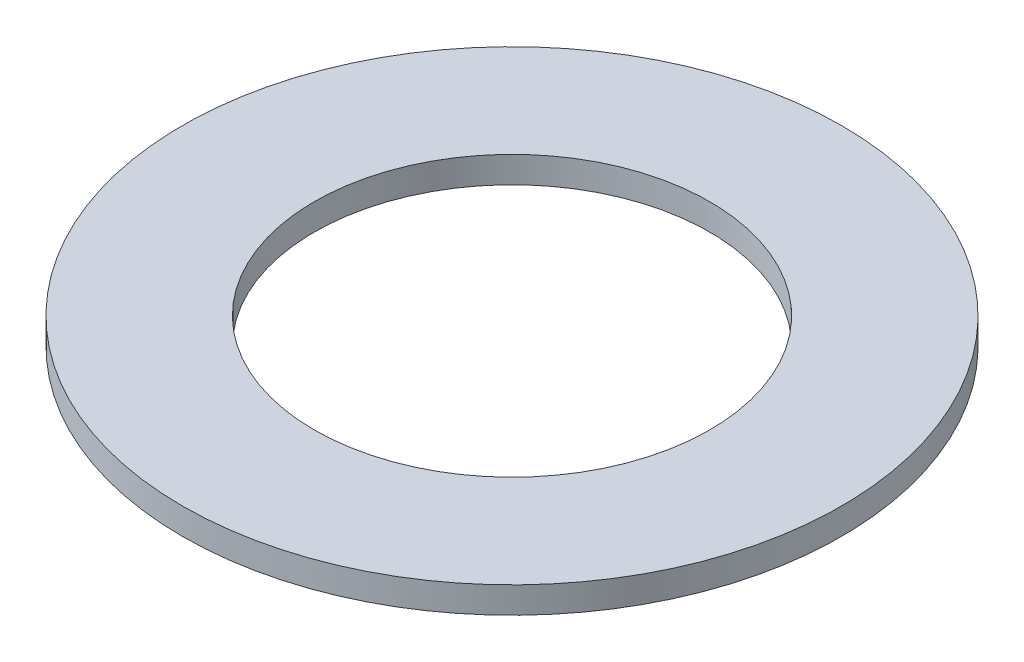
ISO-10303-21;
HEADER;
FILE_DESCRIPTION(('STEP AP214'),'2;1');
FILE_NAME('part.step','',(''),(''),'','','');
FILE_SCHEMA(('AUTOMOTIVE_DESIGN { 1 0 10303 214 1 1 1 1 }'));
ENDSEC;
DATA;
#1=APPLICATION_CONTEXT('core data for automotive mechanical design processes');
#2=APPLICATION_PROTOCOL_DEFINITION('international standard','automotive_design',2000,#1);
#3=PRODUCT_CONTEXT('',#1,'mechanical');
#4=PRODUCT('Part','Part','',(#3));
#5=PRODUCT_RELATED_PRODUCT_CATEGORY('part','',(#4));
#6=PRODUCT_DEFINITION_FORMATION('','',#4);
#7=PRODUCT_DEFINITION_CONTEXT('part definition',#1,'design');
#8=PRODUCT_DEFINITION('design','',#6,#7);
#9=PRODUCT_DEFINITION_SHAPE('','',#8);
#10=(LENGTH_UNIT() NAMED_UNIT(*) SI_UNIT(.MILLI.,.METRE.));
#11=(NAMED_UNIT(*) PLANE_ANGLE_UNIT() SI_UNIT($,.RADIAN.));
#12=(NAMED_UNIT(*) SI_UNIT($,.STERADIAN.) SOLID_ANGLE_UNIT());
#13=UNCERTAINTY_MEASURE_WITH_UNIT(LENGTH_MEASURE(1.E-05),#10,'distance_accuracy_value','');
#14=(GEOMETRIC_REPRESENTATION_CONTEXT(3) GLOBAL_UNCERTAINTY_ASSIGNED_CONTEXT((#13)) GLOBAL_UNIT_ASSIGNED_CONTEXT((#10,
#11,#12)) REPRESENTATION_CONTEXT('',''));
#15=CARTESIAN_POINT('',(0.,0.,0.));
#16=DIRECTION('',(0.,0.,1.));
#17=DIRECTION('',(1.,0.,0.));
#18=AXIS2_PLACEMENT_3D('',#15,#16,#17);
#19=CARTESIAN_POINT('',(0.,6.,0.));
#20=DIRECTION('',(0.,-1.,0.));
#21=DIRECTION('',(0.,0.,-1.));
#22=AXIS2_PLACEMENT_3D('',#19,#20,#21);
#23=CYLINDRICAL_SURFACE('',#22,75.);
#24=CARTESIAN_POINT('',(0.,6.,0.));
#25=DIRECTION('',(0.,1.,0.));
#26=DIRECTION('',(0.,0.,1.));
#27=AXIS2_PLACEMENT_3D('',#24,#25,#26);
#28=CIRCLE('',#27,75.);
#29=CARTESIAN_POINT('',(0.,6.,75.));
#30=VERTEX_POINT('',#29);
#31=EDGE_CURVE('E10',#30,#30,#28,.T.);
#32=ORIENTED_EDGE('',*,*,#31,.F.);
#33=EDGE_LOOP('',(#32));
#34=FACE_BOUND('',#33,.T.);
#35=CARTESIAN_POINT('',(0.,0.,0.));
#36=DIRECTION('',(0.,1.,0.));
#37=DIRECTION('',(0.,0.,1.));
#38=AXIS2_PLACEMENT_3D('',#35,#36,#37);
#39=CIRCLE('',#38,75.);
#40=CARTESIAN_POINT('',(0.,0.,75.));
#41=VERTEX_POINT('',#40);
#42=EDGE_CURVE('E37',#41,#41,#39,.T.);
#43=ORIENTED_EDGE('',*,*,#42,.T.);
#44=EDGE_LOOP('',(#43));
#45=FACE_BOUND('',#44,.T.);
#46=ADVANCED_FACE('F40',(#34,#45),#23,.T.);
#47=CARTESIAN_POINT('',(0.,6.,0.));
#48=DIRECTION('',(0.,1.,0.));
#49=DIRECTION('',(0.,0.,1.));
#50=AXIS2_PLACEMENT_3D('',#47,#48,#49);
#51=PLANE('',#50);
#52=CARTESIAN_POINT('',(0.,6.,0.));
#53=DIRECTION('',(0.,1.,0.));
#54=DIRECTION('',(0.,0.,1.));
#55=AXIS2_PLACEMENT_3D('',#52,#53,#54);
#56=CIRCLE('',#55,45.);
#57=CARTESIAN_POINT('',(0.,6.,45.));
#58=VERTEX_POINT('',#57);
#59=EDGE_CURVE('E50',#58,#58,#56,.T.);
#60=ORIENTED_EDGE('',*,*,#59,.F.);
#61=EDGE_LOOP('',(#60));
#62=FACE_BOUND('',#61,.T.);
#63=ORIENTED_EDGE('',*,*,#31,.T.);
#64=EDGE_LOOP('',(#63));
#65=FACE_BOUND('',#64,.T.);
#66=ADVANCED_FACE('F59',(#62,#65),#51,.T.);
#67=CARTESIAN_POINT('',(0.,0.,0.));
#68=DIRECTION('',(0.,1.,0.));
#69=DIRECTION('',(0.,0.,1.));
#70=AXIS2_PLACEMENT_3D('',#67,#68,#69);
#71=PLANE('',#70);
#72=CARTESIAN_POINT('',(0.,0.,0.));
#73=DIRECTION('',(0.,1.,0.));
#74=DIRECTION('',(0.,0.,1.));
#75=AXIS2_PLACEMENT_3D('',#72,#73,#74);
#76=CIRCLE('',#75,45.);
#77=CARTESIAN_POINT('',(0.,0.,45.));
#78=VERTEX_POINT('',#77);
#79=EDGE_CURVE('E47',#78,#78,#76,.T.);
#80=ORIENTED_EDGE('',*,*,#79,.T.);
#81=EDGE_LOOP('',(#80));
#82=FACE_BOUND('',#81,.T.);
#83=ORIENTED_EDGE('',*,*,#42,.F.);
#84=EDGE_LOOP('',(#83));
#85=FACE_BOUND('',#84,.T.);
#86=ADVANCED_FACE('F58',(#82,#85),#71,.F.);
#87=CARTESIAN_POINT('',(0.,6.,0.));
#88=DIRECTION('',(0.,-1.,0.));
#89=DIRECTION('',(0.,0.,-1.));
#90=AXIS2_PLACEMENT_3D('',#87,#88,#89);
#91=CYLINDRICAL_SURFACE('',#90,45.);
#92=ORIENTED_EDGE('',*,*,#59,.T.);
#93=EDGE_LOOP('',(#92));
#94=FACE_BOUND('',#93,.T.);
#95=ORIENTED_EDGE('',*,*,#79,.F.);
#96=EDGE_LOOP('',(#95));
#97=FACE_BOUND('',#96,.T.);
#98=ADVANCED_FACE('F54',(#94,#97),#91,.F.);
#99=CLOSED_SHELL('',(#46,#66,#86,#98));
#100=MANIFOLD_SOLID_BREP('B2',#99);
#101=ADVANCED_BREP_SHAPE_REPRESENTATION('',(#18,#100),#14);
#102=SHAPE_DEFINITION_REPRESENTATION(#9,#101);
ENDSEC;
END-ISO-10303-21;
